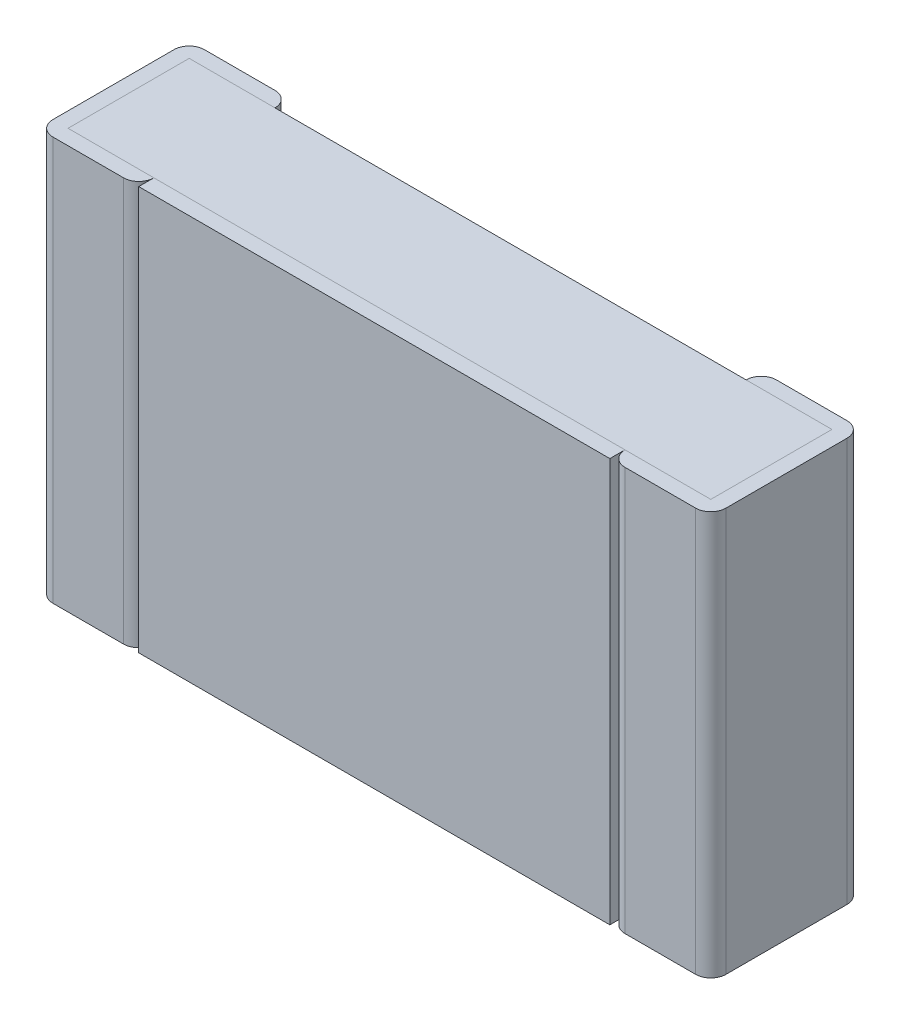
ISO-10303-21;
HEADER;
FILE_DESCRIPTION(('STEP AP214'),'2;1');
FILE_NAME('part.step','',(''),(''),'','','');
FILE_SCHEMA(('AUTOMOTIVE_DESIGN { 1 0 10303 214 1 1 1 1 }'));
ENDSEC;
DATA;
#1=APPLICATION_CONTEXT('core data for automotive mechanical design processes');
#2=APPLICATION_PROTOCOL_DEFINITION('international standard','automotive_design',2000,#1);
#3=PRODUCT_CONTEXT('',#1,'mechanical');
#4=PRODUCT('Part','Part','',(#3));
#5=PRODUCT_RELATED_PRODUCT_CATEGORY('part','',(#4));
#6=PRODUCT_DEFINITION_FORMATION('','',#4);
#7=PRODUCT_DEFINITION_CONTEXT('part definition',#1,'design');
#8=PRODUCT_DEFINITION('design','',#6,#7);
#9=PRODUCT_DEFINITION_SHAPE('','',#8);
#10=(LENGTH_UNIT() NAMED_UNIT(*) SI_UNIT(.MILLI.,.METRE.));
#11=(NAMED_UNIT(*) PLANE_ANGLE_UNIT() SI_UNIT($,.RADIAN.));
#12=(NAMED_UNIT(*) SI_UNIT($,.STERADIAN.) SOLID_ANGLE_UNIT());
#13=UNCERTAINTY_MEASURE_WITH_UNIT(LENGTH_MEASURE(1.E-05),#10,'distance_accuracy_value','');
#14=(GEOMETRIC_REPRESENTATION_CONTEXT(3) GLOBAL_UNCERTAINTY_ASSIGNED_CONTEXT((#13)) GLOBAL_UNIT_ASSIGNED_CONTEXT((#10,
#11,#12)) REPRESENTATION_CONTEXT('',''));
#15=CARTESIAN_POINT('',(0.,0.,0.));
#16=DIRECTION('',(0.,0.,1.));
#17=DIRECTION('',(1.,0.,0.));
#18=AXIS2_PLACEMENT_3D('',#15,#16,#17);
#19=CARTESIAN_POINT('',(-1.,-0.6,0.));
#20=DIRECTION('',(1.,0.,0.));
#21=DIRECTION('',(0.,1.,0.));
#22=AXIS2_PLACEMENT_3D('',#19,#20,#21);
#23=PLANE('',#22);
#24=DIRECTION('',(0.,1.,0.));
#25=VECTOR('',#24,1.);
#26=CARTESIAN_POINT('',(-1.,-0.6,0.405));
#27=LINE('',#26,#25);
#28=CARTESIAN_POINT('',(-1.,-0.6,0.405));
#29=VERTEX_POINT('',#28);
#30=CARTESIAN_POINT('',(-1.,0.6,0.405));
#31=VERTEX_POINT('',#30);
#32=EDGE_CURVE('E11',#29,#31,#27,.T.);
#33=ORIENTED_EDGE('',*,*,#32,.T.);
#34=DIRECTION('',(0.,0.,1.));
#35=VECTOR('',#34,1.);
#36=CARTESIAN_POINT('',(-1.,0.6,0.));
#37=LINE('',#36,#35);
#38=CARTESIAN_POINT('',(-1.,0.6,0.045));
#39=VERTEX_POINT('',#38);
#40=EDGE_CURVE('E41',#39,#31,#37,.T.);
#41=ORIENTED_EDGE('',*,*,#40,.F.);
#42=DIRECTION('',(0.,1.,0.));
#43=VECTOR('',#42,1.);
#44=CARTESIAN_POINT('',(-1.,-0.6,0.045));
#45=LINE('',#44,#43);
#46=CARTESIAN_POINT('',(-1.,-0.6,0.045));
#47=VERTEX_POINT('',#46);
#48=EDGE_CURVE('E289',#47,#39,#45,.T.);
#49=ORIENTED_EDGE('',*,*,#48,.F.);
#50=DIRECTION('',(0.,0.,1.));
#51=VECTOR('',#50,1.);
#52=CARTESIAN_POINT('',(-1.,-0.6,0.));
#53=LINE('',#52,#51);
#54=EDGE_CURVE('E27',#47,#29,#53,.T.);
#55=ORIENTED_EDGE('',*,*,#54,.T.);
#56=EDGE_LOOP('',(#33,#41,#49,#55));
#57=FACE_BOUND('',#56,.T.);
#58=ADVANCED_FACE('F16',(#57),#23,.F.);
#59=CARTESIAN_POINT('',(-1.,-0.6,0.));
#60=DIRECTION('',(0.,1.,0.));
#61=DIRECTION('',(1.,0.,0.));
#62=AXIS2_PLACEMENT_3D('',#59,#60,#61);
#63=PLANE('',#62);
#64=CARTESIAN_POINT('',(-0.745,-0.6,0.045));
#65=DIRECTION('',(0.,1.,0.));
#66=DIRECTION('',(0.,0.,1.));
#67=AXIS2_PLACEMENT_3D('',#64,#65,#66);
#68=CIRCLE('',#67,0.045);
#69=CARTESIAN_POINT('',(-0.7,-0.6,0.045));
#70=VERTEX_POINT('',#69);
#71=CARTESIAN_POINT('',(-0.745,-0.6,0.));
#72=VERTEX_POINT('',#71);
#73=EDGE_CURVE('E234',#70,#72,#68,.T.);
#74=ORIENTED_EDGE('',*,*,#73,.F.);
#75=DIRECTION('',(1.,0.,0.));
#76=VECTOR('',#75,1.);
#77=CARTESIAN_POINT('',(-0.955,-0.6,0.045));
#78=LINE('',#77,#76);
#79=CARTESIAN_POINT('',(-0.955,-0.6,0.045));
#80=VERTEX_POINT('',#79);
#81=EDGE_CURVE('E227',#80,#70,#78,.T.);
#82=ORIENTED_EDGE('',*,*,#81,.F.);
#83=DIRECTION('',(0.,0.,1.));
#84=VECTOR('',#83,1.);
#85=CARTESIAN_POINT('',(-0.955,-0.6,0.045));
#86=LINE('',#85,#84);
#87=CARTESIAN_POINT('',(-0.955,-0.6,0.405));
#88=VERTEX_POINT('',#87);
#89=EDGE_CURVE('E231',#80,#88,#86,.T.);
#90=ORIENTED_EDGE('',*,*,#89,.T.);
#91=DIRECTION('',(1.,0.,0.));
#92=VECTOR('',#91,1.);
#93=CARTESIAN_POINT('',(-0.955,-0.6,0.405));
#94=LINE('',#93,#92);
#95=CARTESIAN_POINT('',(-0.7,-0.6,0.405));
#96=VERTEX_POINT('',#95);
#97=EDGE_CURVE('E243',#88,#96,#94,.T.);
#98=ORIENTED_EDGE('',*,*,#97,.T.);
#99=CARTESIAN_POINT('',(-0.745,-0.6,0.405));
#100=DIRECTION('',(0.,-1.,0.));
#101=DIRECTION('',(0.,0.,1.));
#102=AXIS2_PLACEMENT_3D('',#99,#100,#101);
#103=CIRCLE('',#102,0.045);
#104=CARTESIAN_POINT('',(-0.745,-0.6,0.45));
#105=VERTEX_POINT('',#104);
#106=EDGE_CURVE('E252',#96,#105,#103,.T.);
#107=ORIENTED_EDGE('',*,*,#106,.T.);
#108=DIRECTION('',(1.,0.,0.));
#109=VECTOR('',#108,1.);
#110=CARTESIAN_POINT('',(-1.,-0.6,0.45));
#111=LINE('',#110,#109);
#112=CARTESIAN_POINT('',(-0.955,-0.6,0.45));
#113=VERTEX_POINT('',#112);
#114=EDGE_CURVE('E240',#113,#105,#111,.T.);
#115=ORIENTED_EDGE('',*,*,#114,.F.);
#116=CARTESIAN_POINT('',(-0.955,-0.6,0.405));
#117=DIRECTION('',(0.,1.,0.));
#118=DIRECTION('',(0.,0.,1.));
#119=AXIS2_PLACEMENT_3D('',#116,#117,#118);
#120=CIRCLE('',#119,0.045);
#121=EDGE_CURVE('E377',#29,#113,#120,.T.);
#122=ORIENTED_EDGE('',*,*,#121,.F.);
#123=ORIENTED_EDGE('',*,*,#54,.F.);
#124=CARTESIAN_POINT('',(-0.955,-0.6,0.045));
#125=DIRECTION('',(0.,-1.,0.));
#126=DIRECTION('',(0.,0.,1.));
#127=AXIS2_PLACEMENT_3D('',#124,#125,#126);
#128=CIRCLE('',#127,0.045);
#129=CARTESIAN_POINT('',(-0.955,-0.6,0.));
#130=VERTEX_POINT('',#129);
#131=EDGE_CURVE('E322',#47,#130,#128,.T.);
#132=ORIENTED_EDGE('',*,*,#131,.T.);
#133=DIRECTION('',(1.,0.,0.));
#134=VECTOR('',#133,1.);
#135=CARTESIAN_POINT('',(-1.,-0.6,0.));
#136=LINE('',#135,#134);
#137=EDGE_CURVE('E293',#130,#72,#136,.T.);
#138=ORIENTED_EDGE('',*,*,#137,.T.);
#139=EDGE_LOOP('',(#74,#82,#90,#98,#107,#115,#122,#123,#132,#138));
#140=FACE_BOUND('',#139,.T.);
#141=ADVANCED_FACE('F229',(#140),#63,.F.);
#142=CARTESIAN_POINT('',(-0.955,-0.6,0.045));
#143=DIRECTION('',(0.,1.,0.));
#144=DIRECTION('',(-1.,0.,0.));
#145=AXIS2_PLACEMENT_3D('',#142,#143,#144);
#146=CYLINDRICAL_SURFACE('',#145,0.045);
#147=ORIENTED_EDGE('',*,*,#48,.T.);
#148=CARTESIAN_POINT('',(-0.955,0.6,0.045));
#149=DIRECTION('',(0.,-1.,0.));
#150=DIRECTION('',(0.,0.,1.));
#151=AXIS2_PLACEMENT_3D('',#148,#149,#150);
#152=CIRCLE('',#151,0.045);
#153=CARTESIAN_POINT('',(-0.955,0.6,0.));
#154=VERTEX_POINT('',#153);
#155=EDGE_CURVE('E294',#39,#154,#152,.T.);
#156=ORIENTED_EDGE('',*,*,#155,.T.);
#157=DIRECTION('',(0.,1.,0.));
#158=VECTOR('',#157,1.);
#159=CARTESIAN_POINT('',(-0.955,-0.6,0.));
#160=LINE('',#159,#158);
#161=EDGE_CURVE('E345',#130,#154,#160,.T.);
#162=ORIENTED_EDGE('',*,*,#161,.F.);
#163=ORIENTED_EDGE('',*,*,#131,.F.);
#164=EDGE_LOOP('',(#147,#156,#162,#163));
#165=FACE_BOUND('',#164,.T.);
#166=ADVANCED_FACE('F499',(#165),#146,.T.);
#167=CARTESIAN_POINT('',(-0.955,-0.6,0.405));
#168=DIRECTION('',(0.,1.,0.));
#169=DIRECTION('',(-1.,0.,0.));
#170=AXIS2_PLACEMENT_3D('',#167,#168,#169);
#171=CYLINDRICAL_SURFACE('',#170,0.045);
#172=ORIENTED_EDGE('',*,*,#121,.T.);
#173=DIRECTION('',(0.,1.,0.));
#174=VECTOR('',#173,1.);
#175=CARTESIAN_POINT('',(-0.955,-0.6,0.45));
#176=LINE('',#175,#174);
#177=CARTESIAN_POINT('',(-0.955,0.6,0.45));
#178=VERTEX_POINT('',#177);
#179=EDGE_CURVE('E265',#113,#178,#176,.T.);
#180=ORIENTED_EDGE('',*,*,#179,.T.);
#181=CARTESIAN_POINT('',(-0.955,0.6,0.405));
#182=DIRECTION('',(0.,1.,0.));
#183=DIRECTION('',(0.,0.,1.));
#184=AXIS2_PLACEMENT_3D('',#181,#182,#183);
#185=CIRCLE('',#184,0.045);
#186=EDGE_CURVE('E266',#31,#178,#185,.T.);
#187=ORIENTED_EDGE('',*,*,#186,.F.);
#188=ORIENTED_EDGE('',*,*,#32,.F.);
#189=EDGE_LOOP('',(#172,#180,#187,#188));
#190=FACE_BOUND('',#189,.T.);
#191=ADVANCED_FACE('F506',(#190),#171,.T.);
#192=CARTESIAN_POINT('',(-1.,0.6,0.));
#193=DIRECTION('',(0.,1.,0.));
#194=DIRECTION('',(1.,0.,0.));
#195=AXIS2_PLACEMENT_3D('',#192,#193,#194);
#196=PLANE('',#195);
#197=DIRECTION('',(1.,0.,0.));
#198=VECTOR('',#197,1.);
#199=CARTESIAN_POINT('',(-1.,0.6,0.));
#200=LINE('',#199,#198);
#201=CARTESIAN_POINT('',(-0.745,0.6,0.));
#202=VERTEX_POINT('',#201);
#203=EDGE_CURVE('E311',#154,#202,#200,.T.);
#204=ORIENTED_EDGE('',*,*,#203,.F.);
#205=ORIENTED_EDGE('',*,*,#155,.F.);
#206=ORIENTED_EDGE('',*,*,#40,.T.);
#207=ORIENTED_EDGE('',*,*,#186,.T.);
#208=DIRECTION('',(1.,0.,0.));
#209=VECTOR('',#208,1.);
#210=CARTESIAN_POINT('',(-1.,0.6,0.45));
#211=LINE('',#210,#209);
#212=CARTESIAN_POINT('',(-0.745,0.6,0.45));
#213=VERTEX_POINT('',#212);
#214=EDGE_CURVE('E353',#178,#213,#211,.T.);
#215=ORIENTED_EDGE('',*,*,#214,.T.);
#216=CARTESIAN_POINT('',(-0.745,0.6,0.405));
#217=DIRECTION('',(0.,-1.,0.));
#218=DIRECTION('',(0.,0.,1.));
#219=AXIS2_PLACEMENT_3D('',#216,#217,#218);
#220=CIRCLE('',#219,0.045);
#221=CARTESIAN_POINT('',(-0.7,0.6,0.405));
#222=VERTEX_POINT('',#221);
#223=EDGE_CURVE('E338',#222,#213,#220,.T.);
#224=ORIENTED_EDGE('',*,*,#223,.F.);
#225=DIRECTION('',(1.,0.,0.));
#226=VECTOR('',#225,1.);
#227=CARTESIAN_POINT('',(-0.955,0.6,0.405));
#228=LINE('',#227,#226);
#229=CARTESIAN_POINT('',(-0.955,0.6,0.405));
#230=VERTEX_POINT('',#229);
#231=EDGE_CURVE('E282',#230,#222,#228,.T.);
#232=ORIENTED_EDGE('',*,*,#231,.F.);
#233=DIRECTION('',(0.,0.,1.));
#234=VECTOR('',#233,1.);
#235=CARTESIAN_POINT('',(-0.955,0.6,0.045));
#236=LINE('',#235,#234);
#237=CARTESIAN_POINT('',(-0.955,0.6,0.045));
#238=VERTEX_POINT('',#237);
#239=EDGE_CURVE('E20',#238,#230,#236,.T.);
#240=ORIENTED_EDGE('',*,*,#239,.F.);
#241=DIRECTION('',(1.,0.,0.));
#242=VECTOR('',#241,1.);
#243=CARTESIAN_POINT('',(-0.955,0.6,0.045));
#244=LINE('',#243,#242);
#245=CARTESIAN_POINT('',(-0.7,0.6,0.045));
#246=VERTEX_POINT('',#245);
#247=EDGE_CURVE('E349',#238,#246,#244,.T.);
#248=ORIENTED_EDGE('',*,*,#247,.T.);
#249=CARTESIAN_POINT('',(-0.745,0.6,0.045));
#250=DIRECTION('',(0.,1.,0.));
#251=DIRECTION('',(0.,0.,1.));
#252=AXIS2_PLACEMENT_3D('',#249,#250,#251);
#253=CIRCLE('',#252,0.045);
#254=EDGE_CURVE('E256',#246,#202,#253,.T.);
#255=ORIENTED_EDGE('',*,*,#254,.T.);
#256=EDGE_LOOP('',(#204,#205,#206,#207,#215,#224,#232,#240,#248,#255));
#257=FACE_BOUND('',#256,.T.);
#258=ADVANCED_FACE('F465',(#257),#196,.T.);
#259=CARTESIAN_POINT('',(-1.,-0.6,0.));
#260=DIRECTION('',(0.,0.,1.));
#261=DIRECTION('',(1.,0.,0.));
#262=AXIS2_PLACEMENT_3D('',#259,#260,#261);
#263=PLANE('',#262);
#264=DIRECTION('',(0.,1.,0.));
#265=VECTOR('',#264,1.);
#266=CARTESIAN_POINT('',(-0.745,-0.6,0.));
#267=LINE('',#266,#265);
#268=EDGE_CURVE('E312',#72,#202,#267,.T.);
#269=ORIENTED_EDGE('',*,*,#268,.F.);
#270=ORIENTED_EDGE('',*,*,#137,.F.);
#271=ORIENTED_EDGE('',*,*,#161,.T.);
#272=ORIENTED_EDGE('',*,*,#203,.T.);
#273=EDGE_LOOP('',(#269,#270,#271,#272));
#274=FACE_BOUND('',#273,.T.);
#275=ADVANCED_FACE('F496',(#274),#263,.F.);
#276=CARTESIAN_POINT('',(-0.745,-0.6,0.045));
#277=DIRECTION('',(0.,1.,0.));
#278=DIRECTION('',(1.,0.,0.));
#279=AXIS2_PLACEMENT_3D('',#276,#277,#278);
#280=CYLINDRICAL_SURFACE('',#279,0.045);
#281=ORIENTED_EDGE('',*,*,#73,.T.);
#282=ORIENTED_EDGE('',*,*,#268,.T.);
#283=ORIENTED_EDGE('',*,*,#254,.F.);
#284=DIRECTION('',(0.,1.,0.));
#285=VECTOR('',#284,1.);
#286=CARTESIAN_POINT('',(-0.7,-0.6,0.045));
#287=LINE('',#286,#285);
#288=EDGE_CURVE('E396',#70,#246,#287,.T.);
#289=ORIENTED_EDGE('',*,*,#288,.F.);
#290=EDGE_LOOP('',(#281,#282,#283,#289));
#291=FACE_BOUND('',#290,.T.);
#292=ADVANCED_FACE('F461',(#291),#280,.T.);
#293=CARTESIAN_POINT('',(-0.955,-0.6,0.045));
#294=DIRECTION('',(0.,1.,0.));
#295=DIRECTION('',(1.,0.,0.));
#296=AXIS2_PLACEMENT_3D('',#293,#294,#295);
#297=PLANE('',#296);
#298=DIRECTION('',(1.,0.,0.));
#299=VECTOR('',#298,1.);
#300=CARTESIAN_POINT('',(-0.955,-0.6,0.045));
#301=LINE('',#300,#299);
#302=CARTESIAN_POINT('',(0.7,-0.6,0.045));
#303=VERTEX_POINT('',#302);
#304=EDGE_CURVE('E356',#70,#303,#301,.T.);
#305=ORIENTED_EDGE('',*,*,#304,.T.);
#306=DIRECTION('',(1.,0.,0.));
#307=VECTOR('',#306,1.);
#308=CARTESIAN_POINT('',(-0.955,-0.6,0.045));
#309=LINE('',#308,#307);
#310=CARTESIAN_POINT('',(0.955,-0.6,0.045));
#311=VERTEX_POINT('',#310);
#312=EDGE_CURVE('E354',#303,#311,#309,.T.);
#313=ORIENTED_EDGE('',*,*,#312,.T.);
#314=DIRECTION('',(0.,0.,1.));
#315=VECTOR('',#314,1.);
#316=CARTESIAN_POINT('',(0.955,-0.6,0.045));
#317=LINE('',#316,#315);
#318=CARTESIAN_POINT('',(0.955,-0.6,0.405));
#319=VERTEX_POINT('',#318);
#320=EDGE_CURVE('E239',#311,#319,#317,.T.);
#321=ORIENTED_EDGE('',*,*,#320,.T.);
#322=DIRECTION('',(1.,0.,0.));
#323=VECTOR('',#322,1.);
#324=CARTESIAN_POINT('',(-0.955,-0.6,0.405));
#325=LINE('',#324,#323);
#326=CARTESIAN_POINT('',(0.7,-0.6,0.405));
#327=VERTEX_POINT('',#326);
#328=EDGE_CURVE('E304',#327,#319,#325,.T.);
#329=ORIENTED_EDGE('',*,*,#328,.F.);
#330=DIRECTION('',(1.,0.,0.));
#331=VECTOR('',#330,1.);
#332=CARTESIAN_POINT('',(-0.7,-0.6,0.405));
#333=LINE('',#332,#331);
#334=EDGE_CURVE('E277',#96,#327,#333,.T.);
#335=ORIENTED_EDGE('',*,*,#334,.F.);
#336=ORIENTED_EDGE('',*,*,#97,.F.);
#337=ORIENTED_EDGE('',*,*,#89,.F.);
#338=ORIENTED_EDGE('',*,*,#81,.T.);
#339=EDGE_LOOP('',(#305,#313,#321,#329,#335,#336,#337,#338));
#340=FACE_BOUND('',#339,.T.);
#341=ADVANCED_FACE('F242',(#340),#297,.F.);
#342=CARTESIAN_POINT('',(-1.,-0.6,0.45));
#343=DIRECTION('',(0.,0.,1.));
#344=DIRECTION('',(1.,0.,0.));
#345=AXIS2_PLACEMENT_3D('',#342,#343,#344);
#346=PLANE('',#345);
#347=ORIENTED_EDGE('',*,*,#214,.F.);
#348=ORIENTED_EDGE('',*,*,#179,.F.);
#349=ORIENTED_EDGE('',*,*,#114,.T.);
#350=DIRECTION('',(0.,1.,0.));
#351=VECTOR('',#350,1.);
#352=CARTESIAN_POINT('',(-0.745,-0.6,0.45));
#353=LINE('',#352,#351);
#354=EDGE_CURVE('E337',#105,#213,#353,.T.);
#355=ORIENTED_EDGE('',*,*,#354,.T.);
#356=EDGE_LOOP('',(#347,#348,#349,#355));
#357=FACE_BOUND('',#356,.T.);
#358=ADVANCED_FACE('F510',(#357),#346,.T.);
#359=CARTESIAN_POINT('',(-0.745,-0.6,0.405));
#360=DIRECTION('',(0.,1.,0.));
#361=DIRECTION('',(1.,0.,0.));
#362=AXIS2_PLACEMENT_3D('',#359,#360,#361);
#363=CYLINDRICAL_SURFACE('',#362,0.045);
#364=DIRECTION('',(0.,1.,0.));
#365=VECTOR('',#364,1.);
#366=CARTESIAN_POINT('',(-0.7,-0.6,0.405));
#367=LINE('',#366,#365);
#368=EDGE_CURVE('E333',#96,#222,#367,.T.);
#369=ORIENTED_EDGE('',*,*,#368,.T.);
#370=ORIENTED_EDGE('',*,*,#223,.T.);
#371=ORIENTED_EDGE('',*,*,#354,.F.);
#372=ORIENTED_EDGE('',*,*,#106,.F.);
#373=EDGE_LOOP('',(#369,#370,#371,#372));
#374=FACE_BOUND('',#373,.T.);
#375=ADVANCED_FACE('F521',(#374),#363,.T.);
#376=CARTESIAN_POINT('',(-0.955,0.6,0.045));
#377=DIRECTION('',(0.,1.,0.));
#378=DIRECTION('',(1.,0.,0.));
#379=AXIS2_PLACEMENT_3D('',#376,#377,#378);
#380=PLANE('',#379);
#381=ORIENTED_EDGE('',*,*,#247,.F.);
#382=ORIENTED_EDGE('',*,*,#239,.T.);
#383=ORIENTED_EDGE('',*,*,#231,.T.);
#384=DIRECTION('',(1.,0.,0.));
#385=VECTOR('',#384,1.);
#386=CARTESIAN_POINT('',(-0.7,0.6,0.405));
#387=LINE('',#386,#385);
#388=CARTESIAN_POINT('',(0.7,0.6,0.405));
#389=VERTEX_POINT('',#388);
#390=EDGE_CURVE('E278',#222,#389,#387,.T.);
#391=ORIENTED_EDGE('',*,*,#390,.T.);
#392=DIRECTION('',(1.,0.,0.));
#393=VECTOR('',#392,1.);
#394=CARTESIAN_POINT('',(-0.955,0.6,0.405));
#395=LINE('',#394,#393);
#396=CARTESIAN_POINT('',(0.955,0.6,0.405));
#397=VERTEX_POINT('',#396);
#398=EDGE_CURVE('E283',#389,#397,#395,.T.);
#399=ORIENTED_EDGE('',*,*,#398,.T.);
#400=DIRECTION('',(0.,0.,1.));
#401=VECTOR('',#400,1.);
#402=CARTESIAN_POINT('',(0.955,0.6,0.045));
#403=LINE('',#402,#401);
#404=CARTESIAN_POINT('',(0.955,0.6,0.045));
#405=VERTEX_POINT('',#404);
#406=EDGE_CURVE('E261',#405,#397,#403,.T.);
#407=ORIENTED_EDGE('',*,*,#406,.F.);
#408=DIRECTION('',(1.,0.,0.));
#409=VECTOR('',#408,1.);
#410=CARTESIAN_POINT('',(-0.955,0.6,0.045));
#411=LINE('',#410,#409);
#412=CARTESIAN_POINT('',(0.7,0.6,0.045));
#413=VERTEX_POINT('',#412);
#414=EDGE_CURVE('E384',#413,#405,#411,.T.);
#415=ORIENTED_EDGE('',*,*,#414,.F.);
#416=DIRECTION('',(1.,0.,0.));
#417=VECTOR('',#416,1.);
#418=CARTESIAN_POINT('',(-0.955,0.6,0.045));
#419=LINE('',#418,#417);
#420=EDGE_CURVE('E441',#246,#413,#419,.T.);
#421=ORIENTED_EDGE('',*,*,#420,.F.);
#422=EDGE_LOOP('',(#381,#382,#383,#391,#399,#407,#415,#421));
#423=FACE_BOUND('',#422,.T.);
#424=ADVANCED_FACE('F469',(#423),#380,.T.);
#425=CARTESIAN_POINT('',(-0.955,-0.6,0.045));
#426=DIRECTION('',(0.,0.,1.));
#427=DIRECTION('',(1.,0.,0.));
#428=AXIS2_PLACEMENT_3D('',#425,#426,#427);
#429=PLANE('',#428);
#430=ORIENTED_EDGE('',*,*,#420,.T.);
#431=DIRECTION('',(0.,1.,0.));
#432=VECTOR('',#431,1.);
#433=CARTESIAN_POINT('',(0.7,-0.6,0.045));
#434=LINE('',#433,#432);
#435=EDGE_CURVE('E318',#303,#413,#434,.T.);
#436=ORIENTED_EDGE('',*,*,#435,.F.);
#437=ORIENTED_EDGE('',*,*,#304,.F.);
#438=ORIENTED_EDGE('',*,*,#288,.T.);
#439=EDGE_LOOP('',(#430,#436,#437,#438));
#440=FACE_BOUND('',#439,.T.);
#441=ADVANCED_FACE('F456',(#440),#429,.F.);
#442=CARTESIAN_POINT('',(0.7,-0.6,0.));
#443=DIRECTION('',(0.,1.,0.));
#444=DIRECTION('',(1.,0.,0.));
#445=AXIS2_PLACEMENT_3D('',#442,#443,#444);
#446=PLANE('',#445);
#447=CARTESIAN_POINT('',(0.955,-0.6,0.045));
#448=DIRECTION('',(0.,1.,0.));
#449=DIRECTION('',(0.,0.,1.));
#450=AXIS2_PLACEMENT_3D('',#447,#448,#449);
#451=CIRCLE('',#450,0.045);
#452=CARTESIAN_POINT('',(1.,-0.6,0.045));
#453=VERTEX_POINT('',#452);
#454=CARTESIAN_POINT('',(0.955,-0.6,0.));
#455=VERTEX_POINT('',#454);
#456=EDGE_CURVE('E305',#453,#455,#451,.T.);
#457=ORIENTED_EDGE('',*,*,#456,.F.);
#458=DIRECTION('',(0.,0.,1.));
#459=VECTOR('',#458,1.);
#460=CARTESIAN_POINT('',(1.,-0.6,0.));
#461=LINE('',#460,#459);
#462=CARTESIAN_POINT('',(1.,-0.6,0.405));
#463=VERTEX_POINT('',#462);
#464=EDGE_CURVE('E303',#453,#463,#461,.T.);
#465=ORIENTED_EDGE('',*,*,#464,.T.);
#466=CARTESIAN_POINT('',(0.955,-0.6,0.405));
#467=DIRECTION('',(0.,-1.,0.));
#468=DIRECTION('',(0.,0.,1.));
#469=AXIS2_PLACEMENT_3D('',#466,#467,#468);
#470=CIRCLE('',#469,0.045);
#471=CARTESIAN_POINT('',(0.955,-0.6,0.45));
#472=VERTEX_POINT('',#471);
#473=EDGE_CURVE('E299',#463,#472,#470,.T.);
#474=ORIENTED_EDGE('',*,*,#473,.T.);
#475=DIRECTION('',(1.,0.,0.));
#476=VECTOR('',#475,1.);
#477=CARTESIAN_POINT('',(0.7,-0.6,0.45));
#478=LINE('',#477,#476);
#479=CARTESIAN_POINT('',(0.745,-0.6,0.45));
#480=VERTEX_POINT('',#479);
#481=EDGE_CURVE('E408',#480,#472,#478,.T.);
#482=ORIENTED_EDGE('',*,*,#481,.F.);
#483=CARTESIAN_POINT('',(0.745,-0.6,0.405));
#484=DIRECTION('',(0.,1.,0.));
#485=DIRECTION('',(0.,0.,1.));
#486=AXIS2_PLACEMENT_3D('',#483,#484,#485);
#487=CIRCLE('',#486,0.045);
#488=EDGE_CURVE('E284',#327,#480,#487,.T.);
#489=ORIENTED_EDGE('',*,*,#488,.F.);
#490=ORIENTED_EDGE('',*,*,#328,.T.);
#491=ORIENTED_EDGE('',*,*,#320,.F.);
#492=ORIENTED_EDGE('',*,*,#312,.F.);
#493=CARTESIAN_POINT('',(0.745,-0.6,0.045));
#494=DIRECTION('',(0.,-1.,0.));
#495=DIRECTION('',(0.,0.,1.));
#496=AXIS2_PLACEMENT_3D('',#493,#494,#495);
#497=CIRCLE('',#496,0.045);
#498=CARTESIAN_POINT('',(0.745,-0.6,0.));
#499=VERTEX_POINT('',#498);
#500=EDGE_CURVE('E329',#303,#499,#497,.T.);
#501=ORIENTED_EDGE('',*,*,#500,.T.);
#502=DIRECTION('',(1.,0.,0.));
#503=VECTOR('',#502,1.);
#504=CARTESIAN_POINT('',(0.7,-0.6,0.));
#505=LINE('',#504,#503);
#506=EDGE_CURVE('E276',#499,#455,#505,.T.);
#507=ORIENTED_EDGE('',*,*,#506,.T.);
#508=EDGE_LOOP('',(#457,#465,#474,#482,#489,#490,#491,#492,#501,#507));
#509=FACE_BOUND('',#508,.T.);
#510=ADVANCED_FACE('F484',(#509),#446,.F.);
#511=CARTESIAN_POINT('',(-0.7,-0.6,0.405));
#512=DIRECTION('',(0.,1.,0.));
#513=DIRECTION('',(1.,0.,0.));
#514=AXIS2_PLACEMENT_3D('',#511,#512,#513);
#515=PLANE('',#514);
#516=DIRECTION('',(0.,0.,1.));
#517=VECTOR('',#516,1.);
#518=CARTESIAN_POINT('',(0.7,-0.6,0.405));
#519=LINE('',#518,#517);
#520=CARTESIAN_POINT('',(0.7,-0.6,0.45));
#521=VERTEX_POINT('',#520);
#522=EDGE_CURVE('E273',#327,#521,#519,.T.);
#523=ORIENTED_EDGE('',*,*,#522,.T.);
#524=DIRECTION('',(1.,0.,0.));
#525=VECTOR('',#524,1.);
#526=CARTESIAN_POINT('',(-0.7,-0.6,0.45));
#527=LINE('',#526,#525);
#528=CARTESIAN_POINT('',(-0.7,-0.6,0.45));
#529=VERTEX_POINT('',#528);
#530=EDGE_CURVE('E63',#529,#521,#527,.T.);
#531=ORIENTED_EDGE('',*,*,#530,.F.);
#532=DIRECTION('',(0.,0.,1.));
#533=VECTOR('',#532,1.);
#534=CARTESIAN_POINT('',(-0.7,-0.6,0.405));
#535=LINE('',#534,#533);
#536=EDGE_CURVE('E387',#96,#529,#535,.T.);
#537=ORIENTED_EDGE('',*,*,#536,.F.);
#538=ORIENTED_EDGE('',*,*,#334,.T.);
#539=EDGE_LOOP('',(#523,#531,#537,#538));
#540=FACE_BOUND('',#539,.T.);
#541=ADVANCED_FACE('F535',(#540),#515,.F.);
#542=CARTESIAN_POINT('',(-0.7,-0.6,0.405));
#543=DIRECTION('',(1.,0.,0.));
#544=DIRECTION('',(0.,1.,0.));
#545=AXIS2_PLACEMENT_3D('',#542,#543,#544);
#546=PLANE('',#545);
#547=DIRECTION('',(0.,1.,0.));
#548=VECTOR('',#547,1.);
#549=CARTESIAN_POINT('',(-0.7,-0.6,0.45));
#550=LINE('',#549,#548);
#551=CARTESIAN_POINT('',(-0.7,0.6,0.45));
#552=VERTEX_POINT('',#551);
#553=EDGE_CURVE('E426',#529,#552,#550,.T.);
#554=ORIENTED_EDGE('',*,*,#553,.T.);
#555=DIRECTION('',(0.,0.,1.));
#556=VECTOR('',#555,1.);
#557=CARTESIAN_POINT('',(-0.7,0.6,0.405));
#558=LINE('',#557,#556);
#559=EDGE_CURVE('E85',#222,#552,#558,.T.);
#560=ORIENTED_EDGE('',*,*,#559,.F.);
#561=ORIENTED_EDGE('',*,*,#368,.F.);
#562=ORIENTED_EDGE('',*,*,#536,.T.);
#563=EDGE_LOOP('',(#554,#560,#561,#562));
#564=FACE_BOUND('',#563,.T.);
#565=ADVANCED_FACE('F523',(#564),#546,.F.);
#566=CARTESIAN_POINT('',(0.7,0.6,0.));
#567=DIRECTION('',(0.,1.,0.));
#568=DIRECTION('',(1.,0.,0.));
#569=AXIS2_PLACEMENT_3D('',#566,#567,#568);
#570=PLANE('',#569);
#571=DIRECTION('',(1.,0.,0.));
#572=VECTOR('',#571,1.);
#573=CARTESIAN_POINT('',(0.7,0.6,0.));
#574=LINE('',#573,#572);
#575=CARTESIAN_POINT('',(0.745,0.6,0.));
#576=VERTEX_POINT('',#575);
#577=CARTESIAN_POINT('',(0.955,0.6,0.));
#578=VERTEX_POINT('',#577);
#579=EDGE_CURVE('E272',#576,#578,#574,.T.);
#580=ORIENTED_EDGE('',*,*,#579,.F.);
#581=CARTESIAN_POINT('',(0.745,0.6,0.045));
#582=DIRECTION('',(0.,-1.,0.));
#583=DIRECTION('',(0.,0.,1.));
#584=AXIS2_PLACEMENT_3D('',#581,#582,#583);
#585=CIRCLE('',#584,0.045);
#586=EDGE_CURVE('E271',#413,#576,#585,.T.);
#587=ORIENTED_EDGE('',*,*,#586,.F.);
#588=ORIENTED_EDGE('',*,*,#414,.T.);
#589=ORIENTED_EDGE('',*,*,#406,.T.);
#590=ORIENTED_EDGE('',*,*,#398,.F.);
#591=CARTESIAN_POINT('',(0.745,0.6,0.405));
#592=DIRECTION('',(0.,1.,0.));
#593=DIRECTION('',(0.,0.,1.));
#594=AXIS2_PLACEMENT_3D('',#591,#592,#593);
#595=CIRCLE('',#594,0.045);
#596=CARTESIAN_POINT('',(0.745,0.6,0.45));
#597=VERTEX_POINT('',#596);
#598=EDGE_CURVE('E258',#389,#597,#595,.T.);
#599=ORIENTED_EDGE('',*,*,#598,.T.);
#600=DIRECTION('',(1.,0.,0.));
#601=VECTOR('',#600,1.);
#602=CARTESIAN_POINT('',(0.7,0.6,0.45));
#603=LINE('',#602,#601);
#604=CARTESIAN_POINT('',(0.955,0.6,0.45));
#605=VERTEX_POINT('',#604);
#606=EDGE_CURVE('E262',#597,#605,#603,.T.);
#607=ORIENTED_EDGE('',*,*,#606,.T.);
#608=CARTESIAN_POINT('',(0.955,0.6,0.405));
#609=DIRECTION('',(0.,-1.,0.));
#610=DIRECTION('',(0.,0.,1.));
#611=AXIS2_PLACEMENT_3D('',#608,#609,#610);
#612=CIRCLE('',#611,0.045);
#613=CARTESIAN_POINT('',(1.,0.6,0.405));
#614=VERTEX_POINT('',#613);
#615=EDGE_CURVE('E406',#614,#605,#612,.T.);
#616=ORIENTED_EDGE('',*,*,#615,.F.);
#617=DIRECTION('',(0.,0.,1.));
#618=VECTOR('',#617,1.);
#619=CARTESIAN_POINT('',(1.,0.6,0.));
#620=LINE('',#619,#618);
#621=CARTESIAN_POINT('',(1.,0.6,0.045));
#622=VERTEX_POINT('',#621);
#623=EDGE_CURVE('E400',#622,#614,#620,.T.);
#624=ORIENTED_EDGE('',*,*,#623,.F.);
#625=CARTESIAN_POINT('',(0.955,0.6,0.045));
#626=DIRECTION('',(0.,1.,0.));
#627=DIRECTION('',(0.,0.,1.));
#628=AXIS2_PLACEMENT_3D('',#625,#626,#627);
#629=CIRCLE('',#628,0.045);
#630=EDGE_CURVE('E297',#622,#578,#629,.T.);
#631=ORIENTED_EDGE('',*,*,#630,.T.);
#632=EDGE_LOOP('',(#580,#587,#588,#589,#590,#599,#607,#616,#624,#631));
#633=FACE_BOUND('',#632,.T.);
#634=ADVANCED_FACE('F471',(#633),#570,.T.);
#635=CARTESIAN_POINT('',(-0.7,0.6,0.405));
#636=DIRECTION('',(0.,1.,0.));
#637=DIRECTION('',(1.,0.,0.));
#638=AXIS2_PLACEMENT_3D('',#635,#636,#637);
#639=PLANE('',#638);
#640=ORIENTED_EDGE('',*,*,#390,.F.);
#641=ORIENTED_EDGE('',*,*,#559,.T.);
#642=DIRECTION('',(1.,0.,0.));
#643=VECTOR('',#642,1.);
#644=CARTESIAN_POINT('',(-0.7,0.6,0.45));
#645=LINE('',#644,#643);
#646=CARTESIAN_POINT('',(0.7,0.6,0.45));
#647=VERTEX_POINT('',#646);
#648=EDGE_CURVE('E298',#552,#647,#645,.T.);
#649=ORIENTED_EDGE('',*,*,#648,.T.);
#650=DIRECTION('',(0.,0.,1.));
#651=VECTOR('',#650,1.);
#652=CARTESIAN_POINT('',(0.7,0.6,0.405));
#653=LINE('',#652,#651);
#654=EDGE_CURVE('E358',#389,#647,#653,.T.);
#655=ORIENTED_EDGE('',*,*,#654,.F.);
#656=EDGE_LOOP('',(#640,#641,#649,#655));
#657=FACE_BOUND('',#656,.T.);
#658=ADVANCED_FACE('F526',(#657),#639,.T.);
#659=CARTESIAN_POINT('',(0.745,-0.6,0.045));
#660=DIRECTION('',(0.,1.,0.));
#661=DIRECTION('',(-1.,0.,0.));
#662=AXIS2_PLACEMENT_3D('',#659,#660,#661);
#663=CYLINDRICAL_SURFACE('',#662,0.045);
#664=ORIENTED_EDGE('',*,*,#435,.T.);
#665=ORIENTED_EDGE('',*,*,#586,.T.);
#666=DIRECTION('',(0.,1.,0.));
#667=VECTOR('',#666,1.);
#668=CARTESIAN_POINT('',(0.745,-0.6,0.));
#669=LINE('',#668,#667);
#670=EDGE_CURVE('E267',#499,#576,#669,.T.);
#671=ORIENTED_EDGE('',*,*,#670,.F.);
#672=ORIENTED_EDGE('',*,*,#500,.F.);
#673=EDGE_LOOP('',(#664,#665,#671,#672));
#674=FACE_BOUND('',#673,.T.);
#675=ADVANCED_FACE('F476',(#674),#663,.T.);
#676=CARTESIAN_POINT('',(0.7,-0.6,0.));
#677=DIRECTION('',(0.,0.,1.));
#678=DIRECTION('',(1.,0.,0.));
#679=AXIS2_PLACEMENT_3D('',#676,#677,#678);
#680=PLANE('',#679);
#681=DIRECTION('',(0.,1.,0.));
#682=VECTOR('',#681,1.);
#683=CARTESIAN_POINT('',(0.955,-0.6,0.));
#684=LINE('',#683,#682);
#685=EDGE_CURVE('E308',#455,#578,#684,.T.);
#686=ORIENTED_EDGE('',*,*,#685,.F.);
#687=ORIENTED_EDGE('',*,*,#506,.F.);
#688=ORIENTED_EDGE('',*,*,#670,.T.);
#689=ORIENTED_EDGE('',*,*,#579,.T.);
#690=EDGE_LOOP('',(#686,#687,#688,#689));
#691=FACE_BOUND('',#690,.T.);
#692=ADVANCED_FACE('F480',(#691),#680,.F.);
#693=CARTESIAN_POINT('',(0.955,-0.6,0.045));
#694=DIRECTION('',(0.,1.,0.));
#695=DIRECTION('',(1.,0.,0.));
#696=AXIS2_PLACEMENT_3D('',#693,#694,#695);
#697=CYLINDRICAL_SURFACE('',#696,0.045);
#698=ORIENTED_EDGE('',*,*,#456,.T.);
#699=ORIENTED_EDGE('',*,*,#685,.T.);
#700=ORIENTED_EDGE('',*,*,#630,.F.);
#701=DIRECTION('',(0.,1.,0.));
#702=VECTOR('',#701,1.);
#703=CARTESIAN_POINT('',(1.,-0.6,0.045));
#704=LINE('',#703,#702);
#705=EDGE_CURVE('E404',#453,#622,#704,.T.);
#706=ORIENTED_EDGE('',*,*,#705,.F.);
#707=EDGE_LOOP('',(#698,#699,#700,#706));
#708=FACE_BOUND('',#707,.T.);
#709=ADVANCED_FACE('F582',(#708),#697,.T.);
#710=CARTESIAN_POINT('',(1.,-0.6,0.));
#711=DIRECTION('',(1.,0.,0.));
#712=DIRECTION('',(0.,1.,0.));
#713=AXIS2_PLACEMENT_3D('',#710,#711,#712);
#714=PLANE('',#713);
#715=ORIENTED_EDGE('',*,*,#464,.F.);
#716=ORIENTED_EDGE('',*,*,#705,.T.);
#717=ORIENTED_EDGE('',*,*,#623,.T.);
#718=DIRECTION('',(0.,1.,0.));
#719=VECTOR('',#718,1.);
#720=CARTESIAN_POINT('',(1.,-0.6,0.405));
#721=LINE('',#720,#719);
#722=EDGE_CURVE('E405',#463,#614,#721,.T.);
#723=ORIENTED_EDGE('',*,*,#722,.F.);
#724=EDGE_LOOP('',(#715,#716,#717,#723));
#725=FACE_BOUND('',#724,.T.);
#726=ADVANCED_FACE('F556',(#725),#714,.T.);
#727=CARTESIAN_POINT('',(0.955,-0.6,0.405));
#728=DIRECTION('',(0.,1.,0.));
#729=DIRECTION('',(1.,0.,0.));
#730=AXIS2_PLACEMENT_3D('',#727,#728,#729);
#731=CYLINDRICAL_SURFACE('',#730,0.045);
#732=ORIENTED_EDGE('',*,*,#722,.T.);
#733=ORIENTED_EDGE('',*,*,#615,.T.);
#734=DIRECTION('',(0.,1.,0.));
#735=VECTOR('',#734,1.);
#736=CARTESIAN_POINT('',(0.955,-0.6,0.45));
#737=LINE('',#736,#735);
#738=EDGE_CURVE('E287',#472,#605,#737,.T.);
#739=ORIENTED_EDGE('',*,*,#738,.F.);
#740=ORIENTED_EDGE('',*,*,#473,.F.);
#741=EDGE_LOOP('',(#732,#733,#739,#740));
#742=FACE_BOUND('',#741,.T.);
#743=ADVANCED_FACE('F591',(#742),#731,.T.);
#744=CARTESIAN_POINT('',(0.7,-0.6,0.45));
#745=DIRECTION('',(0.,0.,1.));
#746=DIRECTION('',(1.,0.,0.));
#747=AXIS2_PLACEMENT_3D('',#744,#745,#746);
#748=PLANE('',#747);
#749=ORIENTED_EDGE('',*,*,#606,.F.);
#750=DIRECTION('',(0.,1.,0.));
#751=VECTOR('',#750,1.);
#752=CARTESIAN_POINT('',(0.745,-0.6,0.45));
#753=LINE('',#752,#751);
#754=EDGE_CURVE('E288',#480,#597,#753,.T.);
#755=ORIENTED_EDGE('',*,*,#754,.F.);
#756=ORIENTED_EDGE('',*,*,#481,.T.);
#757=ORIENTED_EDGE('',*,*,#738,.T.);
#758=EDGE_LOOP('',(#749,#755,#756,#757));
#759=FACE_BOUND('',#758,.T.);
#760=ADVANCED_FACE('F575',(#759),#748,.T.);
#761=CARTESIAN_POINT('',(0.745,-0.6,0.405));
#762=DIRECTION('',(0.,1.,0.));
#763=DIRECTION('',(-1.,0.,0.));
#764=AXIS2_PLACEMENT_3D('',#761,#762,#763);
#765=CYLINDRICAL_SURFACE('',#764,0.045);
#766=ORIENTED_EDGE('',*,*,#488,.T.);
#767=ORIENTED_EDGE('',*,*,#754,.T.);
#768=ORIENTED_EDGE('',*,*,#598,.F.);
#769=DIRECTION('',(0.,1.,0.));
#770=VECTOR('',#769,1.);
#771=CARTESIAN_POINT('',(0.7,-0.6,0.405));
#772=LINE('',#771,#770);
#773=EDGE_CURVE('E341',#327,#389,#772,.T.);
#774=ORIENTED_EDGE('',*,*,#773,.F.);
#775=EDGE_LOOP('',(#766,#767,#768,#774));
#776=FACE_BOUND('',#775,.T.);
#777=ADVANCED_FACE('F530',(#776),#765,.T.);
#778=CARTESIAN_POINT('',(0.7,-0.6,0.405));
#779=DIRECTION('',(1.,0.,0.));
#780=DIRECTION('',(0.,1.,0.));
#781=AXIS2_PLACEMENT_3D('',#778,#779,#780);
#782=PLANE('',#781);
#783=ORIENTED_EDGE('',*,*,#522,.F.);
#784=ORIENTED_EDGE('',*,*,#773,.T.);
#785=ORIENTED_EDGE('',*,*,#654,.T.);
#786=DIRECTION('',(0.,1.,0.));
#787=VECTOR('',#786,1.);
#788=CARTESIAN_POINT('',(0.7,-0.6,0.45));
#789=LINE('',#788,#787);
#790=EDGE_CURVE('E319',#521,#647,#789,.T.);
#791=ORIENTED_EDGE('',*,*,#790,.F.);
#792=EDGE_LOOP('',(#783,#784,#785,#791));
#793=FACE_BOUND('',#792,.T.);
#794=ADVANCED_FACE('F18',(#793),#782,.T.);
#795=CARTESIAN_POINT('',(-0.7,-0.6,0.45));
#796=DIRECTION('',(0.,0.,1.));
#797=DIRECTION('',(1.,0.,0.));
#798=AXIS2_PLACEMENT_3D('',#795,#796,#797);
#799=PLANE('',#798);
#800=ORIENTED_EDGE('',*,*,#553,.F.);
#801=ORIENTED_EDGE('',*,*,#530,.T.);
#802=ORIENTED_EDGE('',*,*,#790,.T.);
#803=ORIENTED_EDGE('',*,*,#648,.F.);
#804=EDGE_LOOP('',(#800,#801,#802,#803));
#805=FACE_BOUND('',#804,.T.);
#806=ADVANCED_FACE('F525',(#805),#799,.T.);
#807=CLOSED_SHELL('',(#58,#141,#166,#191,#258,#275,#292,#341,#358,#375,#424,#441,#510,#541,#565,
#634,#658,#675,#692,#709,#726,#743,#760,#777,#794,#806));
#808=MANIFOLD_SOLID_BREP('B1',#807);
#809=ADVANCED_BREP_SHAPE_REPRESENTATION('',(#18,#808),#14);
#810=SHAPE_DEFINITION_REPRESENTATION(#9,#809);
ENDSEC;
END-ISO-10303-21;
